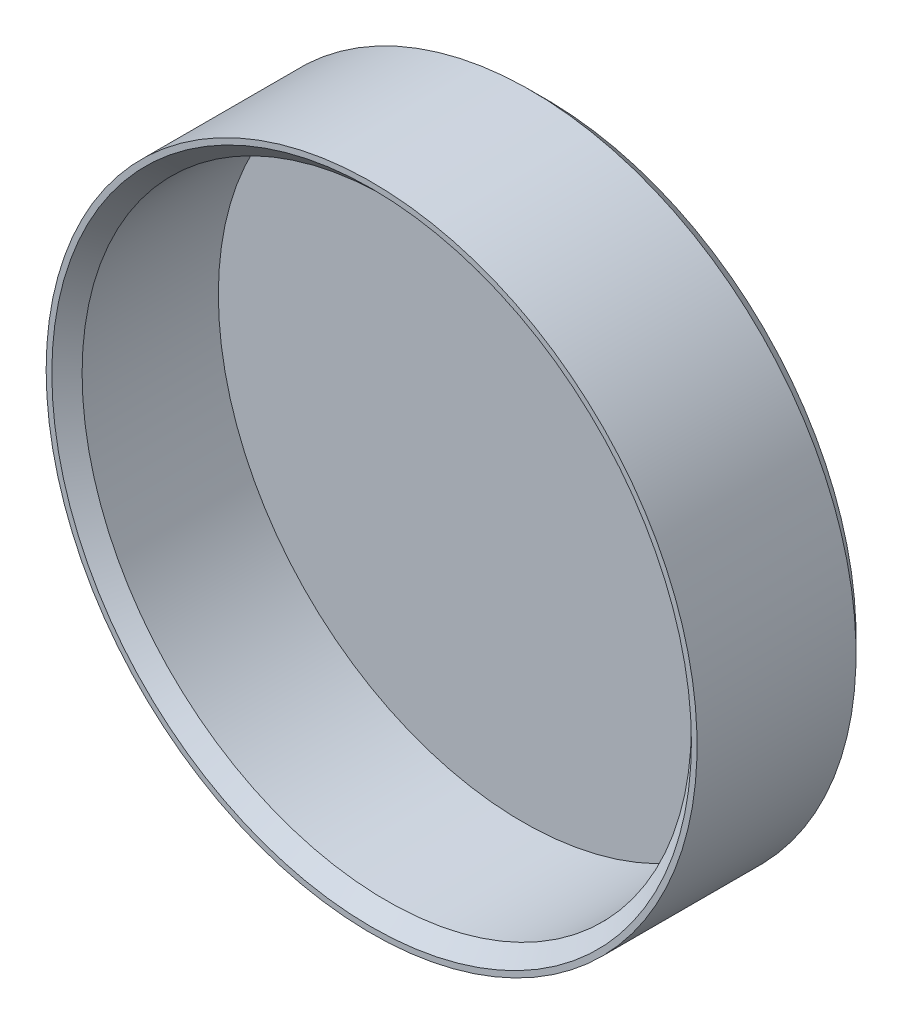
ISO-10303-21;
HEADER;
FILE_DESCRIPTION(('STEP AP214'),'2;1');
FILE_NAME('part.step','',(''),(''),'','','');
FILE_SCHEMA(('AUTOMOTIVE_DESIGN { 1 0 10303 214 1 1 1 1 }'));
ENDSEC;
DATA;
#1=APPLICATION_CONTEXT('core data for automotive mechanical design processes');
#2=APPLICATION_PROTOCOL_DEFINITION('international standard','automotive_design',2000,#1);
#3=PRODUCT_CONTEXT('',#1,'mechanical');
#4=PRODUCT('Part','Part','',(#3));
#5=PRODUCT_RELATED_PRODUCT_CATEGORY('part','',(#4));
#6=PRODUCT_DEFINITION_FORMATION('','',#4);
#7=PRODUCT_DEFINITION_CONTEXT('part definition',#1,'design');
#8=PRODUCT_DEFINITION('design','',#6,#7);
#9=PRODUCT_DEFINITION_SHAPE('','',#8);
#10=(LENGTH_UNIT() NAMED_UNIT(*) SI_UNIT(.MILLI.,.METRE.));
#11=(NAMED_UNIT(*) PLANE_ANGLE_UNIT() SI_UNIT($,.RADIAN.));
#12=(NAMED_UNIT(*) SI_UNIT($,.STERADIAN.) SOLID_ANGLE_UNIT());
#13=UNCERTAINTY_MEASURE_WITH_UNIT(LENGTH_MEASURE(1.E-05),#10,'distance_accuracy_value','');
#14=(GEOMETRIC_REPRESENTATION_CONTEXT(3) GLOBAL_UNCERTAINTY_ASSIGNED_CONTEXT((#13)) GLOBAL_UNIT_ASSIGNED_CONTEXT((#10,
#11,#12)) REPRESENTATION_CONTEXT('',''));
#15=CARTESIAN_POINT('',(0.,0.,0.));
#16=DIRECTION('',(0.,0.,1.));
#17=DIRECTION('',(1.,0.,0.));
#18=AXIS2_PLACEMENT_3D('',#15,#16,#17);
#19=CARTESIAN_POINT('',(0.,0.,0.));
#20=DIRECTION('',(0.,0.,1.));
#21=DIRECTION('',(1.,0.,0.));
#22=AXIS2_PLACEMENT_3D('',#19,#20,#21);
#23=PLANE('',#22);
#24=CARTESIAN_POINT('',(0.,0.,0.));
#25=DIRECTION('',(0.,0.,-1.));
#26=DIRECTION('',(-1.,0.,0.));
#27=AXIS2_PLACEMENT_3D('',#24,#25,#26);
#28=CIRCLE('',#27,40.25);
#29=CARTESIAN_POINT('',(-40.25,0.,0.));
#30=VERTEX_POINT('',#29);
#31=EDGE_CURVE('E12',#30,#30,#28,.T.);
#32=ORIENTED_EDGE('',*,*,#31,.F.);
#33=EDGE_LOOP('',(#32));
#34=FACE_BOUND('',#33,.T.);
#35=ADVANCED_FACE('F45',(#34),#23,.T.);
#36=CARTESIAN_POINT('',(0.,0.,-3.00000000000001));
#37=DIRECTION('',(0.,0.,-1.));
#38=DIRECTION('',(-1.,0.,0.));
#39=AXIS2_PLACEMENT_3D('',#36,#37,#38);
#40=CYLINDRICAL_SURFACE('',#39,40.25);
#41=ORIENTED_EDGE('',*,*,#31,.T.);
#42=EDGE_LOOP('',(#41));
#43=FACE_BOUND('',#42,.T.);
#44=CARTESIAN_POINT('',(0.,0.,18.));
#45=DIRECTION('',(0.,0.,-1.));
#46=DIRECTION('',(-1.,0.,0.));
#47=AXIS2_PLACEMENT_3D('',#44,#45,#46);
#48=CIRCLE('',#47,40.25);
#49=CARTESIAN_POINT('',(-40.25,0.,18.));
#50=VERTEX_POINT('',#49);
#51=EDGE_CURVE('E52',#50,#50,#48,.T.);
#52=ORIENTED_EDGE('',*,*,#51,.F.);
#53=EDGE_LOOP('',(#52));
#54=FACE_BOUND('',#53,.T.);
#55=ADVANCED_FACE('F93',(#43,#54),#40,.F.);
#56=CARTESIAN_POINT('',(0.,0.,20.));
#57=DIRECTION('',(0.,0.,1.));
#58=DIRECTION('',(1.,0.,0.));
#59=AXIS2_PLACEMENT_3D('',#56,#57,#58);
#60=CONICAL_SURFACE('',#59,42.25,0.785398163397449);
#61=ORIENTED_EDGE('',*,*,#51,.T.);
#62=EDGE_LOOP('',(#61));
#63=FACE_BOUND('',#62,.T.);
#64=CARTESIAN_POINT('',(0.,0.,20.));
#65=DIRECTION('',(0.,0.,-1.));
#66=DIRECTION('',(-1.,0.,0.));
#67=AXIS2_PLACEMENT_3D('',#64,#65,#66);
#68=CIRCLE('',#67,42.25);
#69=CARTESIAN_POINT('',(-42.25,0.,20.));
#70=VERTEX_POINT('',#69);
#71=EDGE_CURVE('E58',#70,#70,#68,.T.);
#72=ORIENTED_EDGE('',*,*,#71,.F.);
#73=EDGE_LOOP('',(#72));
#74=FACE_BOUND('',#73,.T.);
#75=ADVANCED_FACE('F98',(#63,#74),#60,.F.);
#76=CARTESIAN_POINT('',(0.,42.25,20.));
#77=DIRECTION('',(0.,0.,1.));
#78=DIRECTION('',(1.,0.,0.));
#79=AXIS2_PLACEMENT_3D('',#76,#77,#78);
#80=PLANE('',#79);
#81=ORIENTED_EDGE('',*,*,#71,.T.);
#82=EDGE_LOOP('',(#81));
#83=FACE_BOUND('',#82,.T.);
#84=CARTESIAN_POINT('',(0.,0.,20.));
#85=DIRECTION('',(0.,0.,-1.));
#86=DIRECTION('',(-1.,0.,0.));
#87=AXIS2_PLACEMENT_3D('',#84,#85,#86);
#88=CIRCLE('',#87,43.);
#89=CARTESIAN_POINT('',(-43.,0.,20.));
#90=VERTEX_POINT('',#89);
#91=EDGE_CURVE('E63',#90,#90,#88,.T.);
#92=ORIENTED_EDGE('',*,*,#91,.F.);
#93=EDGE_LOOP('',(#92));
#94=FACE_BOUND('',#93,.T.);
#95=ADVANCED_FACE('F89',(#83,#94),#80,.T.);
#96=CARTESIAN_POINT('',(0.,0.,-3.00000000000001));
#97=DIRECTION('',(0.,0.,-1.));
#98=DIRECTION('',(-1.,0.,0.));
#99=AXIS2_PLACEMENT_3D('',#96,#97,#98);
#100=CYLINDRICAL_SURFACE('',#99,43.);
#101=ORIENTED_EDGE('',*,*,#91,.T.);
#102=EDGE_LOOP('',(#101));
#103=FACE_BOUND('',#102,.T.);
#104=CARTESIAN_POINT('',(0.,0.,-0.999999999999999));
#105=DIRECTION('',(0.,0.,-1.));
#106=DIRECTION('',(-1.,0.,0.));
#107=AXIS2_PLACEMENT_3D('',#104,#105,#106);
#108=CIRCLE('',#107,43.);
#109=CARTESIAN_POINT('',(-43.,0.,-0.999999999999999));
#110=VERTEX_POINT('',#109);
#111=EDGE_CURVE('E69',#110,#110,#108,.T.);
#112=ORIENTED_EDGE('',*,*,#111,.F.);
#113=EDGE_LOOP('',(#112));
#114=FACE_BOUND('',#113,.T.);
#115=ADVANCED_FACE('F81',(#103,#114),#100,.T.);
#116=CARTESIAN_POINT('',(0.,0.,-3.));
#117=DIRECTION('',(0.,0.,1.));
#118=DIRECTION('',(1.,0.,0.));
#119=AXIS2_PLACEMENT_3D('',#116,#117,#118);
#120=CONICAL_SURFACE('',#119,41.,0.785398163397449);
#121=ORIENTED_EDGE('',*,*,#111,.T.);
#122=EDGE_LOOP('',(#121));
#123=FACE_BOUND('',#122,.T.);
#124=CARTESIAN_POINT('',(0.,0.,-3.));
#125=DIRECTION('',(0.,0.,-1.));
#126=DIRECTION('',(-1.,0.,0.));
#127=AXIS2_PLACEMENT_3D('',#124,#125,#126);
#128=CIRCLE('',#127,41.);
#129=CARTESIAN_POINT('',(-41.,0.,-3.));
#130=VERTEX_POINT('',#129);
#131=EDGE_CURVE('E73',#130,#130,#128,.T.);
#132=ORIENTED_EDGE('',*,*,#131,.F.);
#133=EDGE_LOOP('',(#132));
#134=FACE_BOUND('',#133,.T.);
#135=ADVANCED_FACE('F79',(#123,#134),#120,.T.);
#136=CARTESIAN_POINT('',(0.,41.,-3.));
#137=DIRECTION('',(0.,0.,-1.));
#138=DIRECTION('',(-1.,0.,0.));
#139=AXIS2_PLACEMENT_3D('',#136,#137,#138);
#140=PLANE('',#139);
#141=ORIENTED_EDGE('',*,*,#131,.T.);
#142=EDGE_LOOP('',(#141));
#143=FACE_BOUND('',#142,.T.);
#144=ADVANCED_FACE('F77',(#143),#140,.T.);
#145=CLOSED_SHELL('',(#35,#55,#75,#95,#115,#135,#144));
#146=MANIFOLD_SOLID_BREP('B2',#145);
#147=ADVANCED_BREP_SHAPE_REPRESENTATION('',(#18,#146),#14);
#148=SHAPE_DEFINITION_REPRESENTATION(#9,#147);
ENDSEC;
END-ISO-10303-21;
